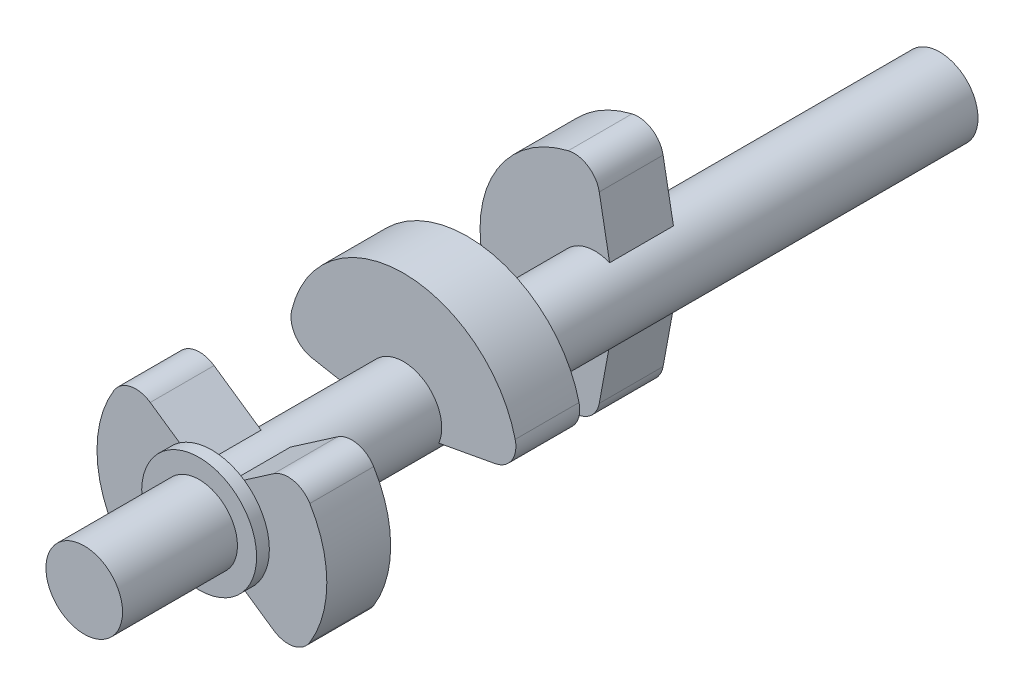
ISO-10303-21;
HEADER;
FILE_DESCRIPTION(('STEP AP214'),'2;1');
FILE_NAME('part.step','',(''),(''),'','','');
FILE_SCHEMA(('AUTOMOTIVE_DESIGN { 1 0 10303 214 1 1 1 1 }'));
ENDSEC;
DATA;
#1=APPLICATION_CONTEXT('core data for automotive mechanical design processes');
#2=APPLICATION_PROTOCOL_DEFINITION('international standard','automotive_design',2000,#1);
#3=PRODUCT_CONTEXT('',#1,'mechanical');
#4=PRODUCT('Part','Part','',(#3));
#5=PRODUCT_RELATED_PRODUCT_CATEGORY('part','',(#4));
#6=PRODUCT_DEFINITION_FORMATION('','',#4);
#7=PRODUCT_DEFINITION_CONTEXT('part definition',#1,'design');
#8=PRODUCT_DEFINITION('design','',#6,#7);
#9=PRODUCT_DEFINITION_SHAPE('','',#8);
#10=(LENGTH_UNIT() NAMED_UNIT(*) SI_UNIT(.MILLI.,.METRE.));
#11=(NAMED_UNIT(*) PLANE_ANGLE_UNIT() SI_UNIT($,.RADIAN.));
#12=(NAMED_UNIT(*) SI_UNIT($,.STERADIAN.) SOLID_ANGLE_UNIT());
#13=UNCERTAINTY_MEASURE_WITH_UNIT(LENGTH_MEASURE(1.E-05),#10,'distance_accuracy_value','');
#14=(GEOMETRIC_REPRESENTATION_CONTEXT(3) GLOBAL_UNCERTAINTY_ASSIGNED_CONTEXT((#13)) GLOBAL_UNIT_ASSIGNED_CONTEXT((#10,
#11,#12)) REPRESENTATION_CONTEXT('',''));
#15=CARTESIAN_POINT('',(0.,0.,0.));
#16=DIRECTION('',(0.,0.,1.));
#17=DIRECTION('',(1.,0.,0.));
#18=AXIS2_PLACEMENT_3D('',#15,#16,#17);
#19=CARTESIAN_POINT('',(0.,0.,33.5));
#20=DIRECTION('',(0.,0.,-1.));
#21=DIRECTION('',(-1.,0.,0.));
#22=AXIS2_PLACEMENT_3D('',#19,#20,#21);
#23=CYLINDRICAL_SURFACE('',#22,1.5);
#24=CARTESIAN_POINT('',(0.,0.,21.));
#25=DIRECTION('',(0.,0.,-1.));
#26=DIRECTION('',(-1.,0.,0.));
#27=AXIS2_PLACEMENT_3D('',#24,#25,#26);
#28=CIRCLE('',#27,1.5);
#29=CARTESIAN_POINT('',(-1.38581929876693,-0.574025148547635,21.));
#30=VERTEX_POINT('',#29);
#31=CARTESIAN_POINT('',(1.38581929876693,-0.574025148547635,21.));
#32=VERTEX_POINT('',#31);
#33=EDGE_CURVE('E300',#30,#32,#28,.T.);
#34=ORIENTED_EDGE('',*,*,#33,.F.);
#35=DIRECTION('',(0.,0.,-1.));
#36=VECTOR('',#35,1.);
#37=CARTESIAN_POINT('',(-1.38581929876693,-0.574025148547635,21.));
#38=LINE('',#37,#36);
#39=CARTESIAN_POINT('',(-1.38581929876693,-0.574025148547635,18.5));
#40=VERTEX_POINT('',#39);
#41=EDGE_CURVE('E311',#30,#40,#38,.T.);
#42=ORIENTED_EDGE('',*,*,#41,.T.);
#43=CARTESIAN_POINT('',(0.,0.,18.5));
#44=DIRECTION('',(0.,0.,-1.));
#45=DIRECTION('',(-1.,0.,0.));
#46=AXIS2_PLACEMENT_3D('',#43,#44,#45);
#47=CIRCLE('',#46,1.5);
#48=CARTESIAN_POINT('',(1.38581929876693,-0.574025148547635,18.5));
#49=VERTEX_POINT('',#48);
#50=EDGE_CURVE('E297',#40,#49,#47,.T.);
#51=ORIENTED_EDGE('',*,*,#50,.T.);
#52=DIRECTION('',(0.,0.,-1.));
#53=VECTOR('',#52,1.);
#54=CARTESIAN_POINT('',(1.38581929876693,-0.574025148547635,21.));
#55=LINE('',#54,#53);
#56=EDGE_CURVE('E320',#32,#49,#55,.T.);
#57=ORIENTED_EDGE('',*,*,#56,.F.);
#58=EDGE_LOOP('',(#34,#42,#51,#57));
#59=FACE_BOUND('',#58,.T.);
#60=CARTESIAN_POINT('',(0.,0.,0.));
#61=DIRECTION('',(0.,0.,1.));
#62=DIRECTION('',(1.,0.,0.));
#63=AXIS2_PLACEMENT_3D('',#60,#61,#62);
#64=CIRCLE('',#63,1.5);
#65=CARTESIAN_POINT('',(1.5,0.,0.));
#66=VERTEX_POINT('',#65);
#67=EDGE_CURVE('E349',#66,#66,#64,.T.);
#68=ORIENTED_EDGE('',*,*,#67,.T.);
#69=EDGE_LOOP('',(#68));
#70=FACE_BOUND('',#69,.T.);
#71=CARTESIAN_POINT('',(0.,0.,13.5));
#72=DIRECTION('',(0.,0.,-1.));
#73=DIRECTION('',(-1.,0.,0.));
#74=AXIS2_PLACEMENT_3D('',#71,#72,#73);
#75=CIRCLE('',#74,1.5);
#76=CARTESIAN_POINT('',(0.574025148547635,-1.38581929876693,13.5));
#77=VERTEX_POINT('',#76);
#78=CARTESIAN_POINT('',(0.574025148547636,1.38581929876693,13.5));
#79=VERTEX_POINT('',#78);
#80=EDGE_CURVE('E326',#77,#79,#75,.T.);
#81=ORIENTED_EDGE('',*,*,#80,.F.);
#82=DIRECTION('',(0.,0.,-1.));
#83=VECTOR('',#82,1.);
#84=CARTESIAN_POINT('',(0.574025148547635,-1.38581929876693,13.5));
#85=LINE('',#84,#83);
#86=CARTESIAN_POINT('',(0.574025148547635,-1.38581929876693,11.));
#87=VERTEX_POINT('',#86);
#88=EDGE_CURVE('E337',#77,#87,#85,.T.);
#89=ORIENTED_EDGE('',*,*,#88,.T.);
#90=CARTESIAN_POINT('',(0.,0.,11.));
#91=DIRECTION('',(0.,0.,-1.));
#92=DIRECTION('',(-1.,0.,0.));
#93=AXIS2_PLACEMENT_3D('',#90,#91,#92);
#94=CIRCLE('',#93,1.5);
#95=CARTESIAN_POINT('',(0.574025148547636,1.38581929876693,11.));
#96=VERTEX_POINT('',#95);
#97=EDGE_CURVE('E323',#87,#96,#94,.T.);
#98=ORIENTED_EDGE('',*,*,#97,.T.);
#99=DIRECTION('',(0.,0.,-1.));
#100=VECTOR('',#99,1.);
#101=CARTESIAN_POINT('',(0.574025148547636,1.38581929876693,13.5));
#102=LINE('',#101,#100);
#103=EDGE_CURVE('E346',#79,#96,#102,.T.);
#104=ORIENTED_EDGE('',*,*,#103,.F.);
#105=EDGE_LOOP('',(#81,#89,#98,#104));
#106=FACE_BOUND('',#105,.T.);
#107=CARTESIAN_POINT('',(0.,0.,28.5));
#108=DIRECTION('',(0.,0.,1.));
#109=DIRECTION('',(1.,0.,0.));
#110=AXIS2_PLACEMENT_3D('',#107,#108,#109);
#111=CIRCLE('',#110,1.5);
#112=CARTESIAN_POINT('',(0.574025148547635,1.38581929876693,28.5));
#113=VERTEX_POINT('',#112);
#114=CARTESIAN_POINT('',(-0.574025148547635,1.38581929876693,28.5));
#115=VERTEX_POINT('',#114);
#116=EDGE_CURVE('E255',#113,#115,#111,.T.);
#117=ORIENTED_EDGE('',*,*,#116,.F.);
#118=DIRECTION('',(0.,0.,-1.));
#119=VECTOR('',#118,1.);
#120=CARTESIAN_POINT('',(0.574025148547635,1.38581929876693,28.5));
#121=LINE('',#120,#119);
#122=CARTESIAN_POINT('',(0.574025148547635,1.38581929876693,26.));
#123=VERTEX_POINT('',#122);
#124=EDGE_CURVE('E285',#113,#123,#121,.T.);
#125=ORIENTED_EDGE('',*,*,#124,.T.);
#126=CARTESIAN_POINT('',(0.,0.,26.));
#127=DIRECTION('',(0.,0.,-1.));
#128=DIRECTION('',(-1.,0.,0.));
#129=AXIS2_PLACEMENT_3D('',#126,#127,#128);
#130=CIRCLE('',#129,1.5);
#131=CARTESIAN_POINT('',(0.574025148547635,-1.38581929876693,26.));
#132=VERTEX_POINT('',#131);
#133=EDGE_CURVE('E275',#123,#132,#130,.T.);
#134=ORIENTED_EDGE('',*,*,#133,.T.);
#135=DIRECTION('',(0.,0.,-1.));
#136=VECTOR('',#135,1.);
#137=CARTESIAN_POINT('',(0.574025148547635,-1.38581929876693,28.5));
#138=LINE('',#137,#136);
#139=CARTESIAN_POINT('',(0.574025148547635,-1.38581929876693,28.5));
#140=VERTEX_POINT('',#139);
#141=EDGE_CURVE('E294',#140,#132,#138,.T.);
#142=ORIENTED_EDGE('',*,*,#141,.F.);
#143=CARTESIAN_POINT('',(-0.574025148547635,-1.38581929876693,28.5));
#144=VERTEX_POINT('',#143);
#145=EDGE_CURVE('E251',#144,#140,#111,.T.);
#146=ORIENTED_EDGE('',*,*,#145,.F.);
#147=DIRECTION('',(0.,0.,-1.));
#148=VECTOR('',#147,1.);
#149=CARTESIAN_POINT('',(-0.574025148547635,-1.38581929876693,28.5));
#150=LINE('',#149,#148);
#151=CARTESIAN_POINT('',(-0.574025148547635,-1.38581929876693,26.));
#152=VERTEX_POINT('',#151);
#153=EDGE_CURVE('E232',#144,#152,#150,.T.);
#154=ORIENTED_EDGE('',*,*,#153,.T.);
#155=CARTESIAN_POINT('',(0.,0.,26.));
#156=DIRECTION('',(0.,0.,-1.));
#157=DIRECTION('',(-1.,0.,0.));
#158=AXIS2_PLACEMENT_3D('',#155,#156,#157);
#159=CIRCLE('',#158,1.5);
#160=CARTESIAN_POINT('',(-0.574025148547635,1.38581929876693,26.));
#161=VERTEX_POINT('',#160);
#162=EDGE_CURVE('E263',#152,#161,#159,.T.);
#163=ORIENTED_EDGE('',*,*,#162,.T.);
#164=DIRECTION('',(0.,0.,-1.));
#165=VECTOR('',#164,1.);
#166=CARTESIAN_POINT('',(-0.574025148547635,1.38581929876693,28.5));
#167=LINE('',#166,#165);
#168=EDGE_CURVE('E272',#115,#161,#167,.T.);
#169=ORIENTED_EDGE('',*,*,#168,.F.);
#170=EDGE_LOOP('',(#117,#125,#134,#142,#146,#154,#163,#169));
#171=FACE_BOUND('',#170,.T.);
#172=ADVANCED_FACE('F37',(#59,#70,#106,#171),#23,.T.);
#173=CARTESIAN_POINT('',(0.,0.,0.));
#174=DIRECTION('',(0.,0.,1.));
#175=DIRECTION('',(1.,0.,0.));
#176=AXIS2_PLACEMENT_3D('',#173,#174,#175);
#177=PLANE('',#176);
#178=ORIENTED_EDGE('',*,*,#67,.F.);
#179=EDGE_LOOP('',(#178));
#180=FACE_BOUND('',#179,.T.);
#181=ADVANCED_FACE('F457',(#180),#177,.F.);
#182=CARTESIAN_POINT('',(0.802211902275424,0.147868685393882,13.5));
#183=DIRECTION('',(0.983432911862671,0.181272468580607,0.));
#184=DIRECTION('',(-0.181272468580607,0.983432911862672,0.));
#185=AXIS2_PLACEMENT_3D('',#182,#183,#184);
#186=PLANE('',#185);
#187=DIRECTION('',(0.181272468580607,-0.983432911862671,0.));
#188=VECTOR('',#187,1.);
#189=CARTESIAN_POINT('',(0.802211902275424,0.147868685393882,11.));
#190=LINE('',#189,#188);
#191=CARTESIAN_POINT('',(0.168638221778177,3.5851099519235,11.));
#192=VERTEX_POINT('',#191);
#193=EDGE_CURVE('E330',#192,#96,#190,.T.);
#194=ORIENTED_EDGE('',*,*,#193,.F.);
#195=DIRECTION('',(0.,0.,-1.));
#196=VECTOR('',#195,1.);
#197=CARTESIAN_POINT('',(0.168638221778177,3.5851099519235,13.5));
#198=LINE('',#197,#196);
#199=CARTESIAN_POINT('',(0.168638221778177,3.5851099519235,13.5));
#200=VERTEX_POINT('',#199);
#201=EDGE_CURVE('E46',#192,#200,#198,.F.);
#202=ORIENTED_EDGE('',*,*,#201,.T.);
#203=DIRECTION('',(0.181272468580607,-0.983432911862671,0.));
#204=VECTOR('',#203,1.);
#205=CARTESIAN_POINT('',(0.802211902275424,0.147868685393882,13.5));
#206=LINE('',#205,#204);
#207=EDGE_CURVE('E335',#200,#79,#206,.T.);
#208=ORIENTED_EDGE('',*,*,#207,.T.);
#209=ORIENTED_EDGE('',*,*,#103,.T.);
#210=EDGE_LOOP('',(#194,#202,#208,#209));
#211=FACE_BOUND('',#210,.T.);
#212=ADVANCED_FACE('F429',(#211),#186,.T.);
#213=CARTESIAN_POINT('',(0.,0.,13.5));
#214=DIRECTION('',(0.,0.,-1.));
#215=DIRECTION('',(-1.,0.,0.));
#216=AXIS2_PLACEMENT_3D('',#213,#214,#215);
#217=CYLINDRICAL_SURFACE('',#216,4.5);
#218=CARTESIAN_POINT('',(0.,0.,11.));
#219=DIRECTION('',(0.,0.,-1.));
#220=DIRECTION('',(-1.,0.,0.));
#221=AXIS2_PLACEMENT_3D('',#218,#219,#220);
#222=CIRCLE('',#221,4.5);
#223=CARTESIAN_POINT('',(-1.04759317296578,-4.37636247858373,11.));
#224=VERTEX_POINT('',#223);
#225=CARTESIAN_POINT('',(-1.04759317296578,4.37636247858373,11.));
#226=VERTEX_POINT('',#225);
#227=EDGE_CURVE('E342',#224,#226,#222,.T.);
#228=ORIENTED_EDGE('',*,*,#227,.F.);
#229=DIRECTION('',(0.,0.,-1.));
#230=VECTOR('',#229,1.);
#231=CARTESIAN_POINT('',(-1.04759317296578,-4.37636247858373,13.5));
#232=LINE('',#231,#230);
#233=CARTESIAN_POINT('',(-1.04759317296578,-4.37636247858373,13.5));
#234=VERTEX_POINT('',#233);
#235=EDGE_CURVE('E419',#224,#234,#232,.F.);
#236=ORIENTED_EDGE('',*,*,#235,.T.);
#237=CARTESIAN_POINT('',(0.,0.,13.5));
#238=DIRECTION('',(0.,0.,-1.));
#239=DIRECTION('',(-1.,0.,0.));
#240=AXIS2_PLACEMENT_3D('',#237,#238,#239);
#241=CIRCLE('',#240,4.5);
#242=CARTESIAN_POINT('',(-1.04759317296578,4.37636247858373,13.5));
#243=VERTEX_POINT('',#242);
#244=EDGE_CURVE('E332',#234,#243,#241,.T.);
#245=ORIENTED_EDGE('',*,*,#244,.T.);
#246=DIRECTION('',(0.,0.,-1.));
#247=VECTOR('',#246,1.);
#248=CARTESIAN_POINT('',(-1.04759317296578,4.37636247858373,13.5));
#249=LINE('',#248,#247);
#250=EDGE_CURVE('E416',#243,#226,#249,.T.);
#251=ORIENTED_EDGE('',*,*,#250,.T.);
#252=EDGE_LOOP('',(#228,#236,#245,#251));
#253=FACE_BOUND('',#252,.T.);
#254=ADVANCED_FACE('F440',(#253),#217,.T.);
#255=CARTESIAN_POINT('',(0.802211902275422,-0.147868685393881,13.5));
#256=DIRECTION('',(-0.983432911862672,0.181272468580607,0.));
#257=DIRECTION('',(-0.181272468580607,-0.983432911862672,0.));
#258=AXIS2_PLACEMENT_3D('',#255,#256,#257);
#259=PLANE('',#258);
#260=DIRECTION('',(0.181272468580607,0.983432911862672,0.));
#261=VECTOR('',#260,1.);
#262=CARTESIAN_POINT('',(0.802211902275422,-0.147868685393881,13.5));
#263=LINE('',#262,#261);
#264=CARTESIAN_POINT('',(0.168638221778178,-3.58510995192351,13.5));
#265=VERTEX_POINT('',#264);
#266=EDGE_CURVE('E329',#265,#77,#263,.T.);
#267=ORIENTED_EDGE('',*,*,#266,.F.);
#268=DIRECTION('',(0.,0.,1.));
#269=VECTOR('',#268,1.);
#270=CARTESIAN_POINT('',(0.168638221778178,-3.58510995192351,11.));
#271=LINE('',#270,#269);
#272=CARTESIAN_POINT('',(0.168638221778178,-3.58510995192351,11.));
#273=VERTEX_POINT('',#272);
#274=EDGE_CURVE('E409',#265,#273,#271,.F.);
#275=ORIENTED_EDGE('',*,*,#274,.T.);
#276=DIRECTION('',(0.181272468580607,0.983432911862672,0.));
#277=VECTOR('',#276,1.);
#278=CARTESIAN_POINT('',(0.802211902275422,-0.147868685393881,11.));
#279=LINE('',#278,#277);
#280=EDGE_CURVE('E340',#273,#87,#279,.T.);
#281=ORIENTED_EDGE('',*,*,#280,.T.);
#282=ORIENTED_EDGE('',*,*,#88,.F.);
#283=EDGE_LOOP('',(#267,#275,#281,#282));
#284=FACE_BOUND('',#283,.T.);
#285=ADVANCED_FACE('F452',(#284),#259,.F.);
#286=CARTESIAN_POINT('',(0.,0.,13.5));
#287=DIRECTION('',(0.,0.,-1.));
#288=DIRECTION('',(-1.,0.,0.));
#289=AXIS2_PLACEMENT_3D('',#286,#287,#288);
#290=PLANE('',#289);
#291=ORIENTED_EDGE('',*,*,#244,.F.);
#292=CARTESIAN_POINT('',(-0.814794690084494,-3.4038374833429,13.5));
#293=DIRECTION('',(0.,0.,-1.));
#294=DIRECTION('',(-1.,0.,0.));
#295=AXIS2_PLACEMENT_3D('',#292,#293,#294);
#296=CIRCLE('',#295,1.);
#297=EDGE_CURVE('E423',#234,#265,#296,.F.);
#298=ORIENTED_EDGE('',*,*,#297,.T.);
#299=ORIENTED_EDGE('',*,*,#266,.T.);
#300=ORIENTED_EDGE('',*,*,#80,.T.);
#301=ORIENTED_EDGE('',*,*,#207,.F.);
#302=CARTESIAN_POINT('',(-0.814794690084494,3.4038374833429,13.5));
#303=DIRECTION('',(0.,0.,-1.));
#304=DIRECTION('',(-1.,0.,0.));
#305=AXIS2_PLACEMENT_3D('',#302,#303,#304);
#306=CIRCLE('',#305,1.);
#307=EDGE_CURVE('E421',#200,#243,#306,.F.);
#308=ORIENTED_EDGE('',*,*,#307,.T.);
#309=EDGE_LOOP('',(#291,#298,#299,#300,#301,#308));
#310=FACE_BOUND('',#309,.T.);
#311=ADVANCED_FACE('F434',(#310),#290,.F.);
#312=CARTESIAN_POINT('',(0.,0.,11.));
#313=DIRECTION('',(0.,0.,-1.));
#314=DIRECTION('',(-1.,0.,0.));
#315=AXIS2_PLACEMENT_3D('',#312,#313,#314);
#316=PLANE('',#315);
#317=ORIENTED_EDGE('',*,*,#280,.F.);
#318=CARTESIAN_POINT('',(-0.814794690084494,-3.4038374833429,11.));
#319=DIRECTION('',(0.,0.,-1.));
#320=DIRECTION('',(-1.,0.,0.));
#321=AXIS2_PLACEMENT_3D('',#318,#319,#320);
#322=CIRCLE('',#321,1.);
#323=EDGE_CURVE('E414',#273,#224,#322,.T.);
#324=ORIENTED_EDGE('',*,*,#323,.T.);
#325=ORIENTED_EDGE('',*,*,#227,.T.);
#326=CARTESIAN_POINT('',(-0.814794690084494,3.4038374833429,11.));
#327=DIRECTION('',(0.,0.,-1.));
#328=DIRECTION('',(-1.,0.,0.));
#329=AXIS2_PLACEMENT_3D('',#326,#327,#328);
#330=CIRCLE('',#329,1.);
#331=EDGE_CURVE('E412',#226,#192,#330,.T.);
#332=ORIENTED_EDGE('',*,*,#331,.T.);
#333=ORIENTED_EDGE('',*,*,#193,.T.);
#334=ORIENTED_EDGE('',*,*,#97,.F.);
#335=EDGE_LOOP('',(#317,#324,#325,#332,#333,#334));
#336=FACE_BOUND('',#335,.T.);
#337=ADVANCED_FACE('F444',(#336),#316,.T.);
#338=CARTESIAN_POINT('',(0.147868685393882,-0.802211902275423,21.));
#339=DIRECTION('',(0.181272468580607,-0.983432911862672,0.));
#340=DIRECTION('',(0.983432911862672,0.181272468580607,0.));
#341=AXIS2_PLACEMENT_3D('',#338,#339,#340);
#342=PLANE('',#341);
#343=DIRECTION('',(-0.983432911862672,-0.181272468580607,0.));
#344=VECTOR('',#343,1.);
#345=CARTESIAN_POINT('',(0.147868685393882,-0.802211902275423,18.5));
#346=LINE('',#345,#344);
#347=CARTESIAN_POINT('',(3.58510995192351,-0.168638221778178,18.5));
#348=VERTEX_POINT('',#347);
#349=EDGE_CURVE('E304',#348,#49,#346,.T.);
#350=ORIENTED_EDGE('',*,*,#349,.F.);
#351=DIRECTION('',(0.,0.,-1.));
#352=VECTOR('',#351,1.);
#353=CARTESIAN_POINT('',(3.5851099519235,-0.168638221778178,21.));
#354=LINE('',#353,#352);
#355=CARTESIAN_POINT('',(3.58510995192351,-0.168638221778178,21.));
#356=VERTEX_POINT('',#355);
#357=EDGE_CURVE('E407',#348,#356,#354,.F.);
#358=ORIENTED_EDGE('',*,*,#357,.T.);
#359=DIRECTION('',(-0.983432911862672,-0.181272468580607,0.));
#360=VECTOR('',#359,1.);
#361=CARTESIAN_POINT('',(0.147868685393882,-0.802211902275423,21.));
#362=LINE('',#361,#360);
#363=EDGE_CURVE('E309',#356,#32,#362,.T.);
#364=ORIENTED_EDGE('',*,*,#363,.T.);
#365=ORIENTED_EDGE('',*,*,#56,.T.);
#366=EDGE_LOOP('',(#350,#358,#364,#365));
#367=FACE_BOUND('',#366,.T.);
#368=ADVANCED_FACE('F665',(#367),#342,.T.);
#369=CARTESIAN_POINT('',(0.,0.,21.));
#370=DIRECTION('',(0.,0.,-1.));
#371=DIRECTION('',(-1.,0.,0.));
#372=AXIS2_PLACEMENT_3D('',#369,#370,#371);
#373=CYLINDRICAL_SURFACE('',#372,4.5);
#374=CARTESIAN_POINT('',(0.,0.,18.5));
#375=DIRECTION('',(0.,0.,-1.));
#376=DIRECTION('',(-1.,0.,0.));
#377=AXIS2_PLACEMENT_3D('',#374,#375,#376);
#378=CIRCLE('',#377,4.5);
#379=CARTESIAN_POINT('',(-4.37636247858373,1.04759317296578,18.5));
#380=VERTEX_POINT('',#379);
#381=CARTESIAN_POINT('',(4.37636247858373,1.04759317296578,18.5));
#382=VERTEX_POINT('',#381);
#383=EDGE_CURVE('E316',#380,#382,#378,.T.);
#384=ORIENTED_EDGE('',*,*,#383,.F.);
#385=DIRECTION('',(0.,0.,-1.));
#386=VECTOR('',#385,1.);
#387=CARTESIAN_POINT('',(-4.37636247858373,1.04759317296578,21.));
#388=LINE('',#387,#386);
#389=CARTESIAN_POINT('',(-4.37636247858373,1.04759317296578,21.));
#390=VERTEX_POINT('',#389);
#391=EDGE_CURVE('E401',#380,#390,#388,.F.);
#392=ORIENTED_EDGE('',*,*,#391,.T.);
#393=CARTESIAN_POINT('',(0.,0.,21.));
#394=DIRECTION('',(0.,0.,-1.));
#395=DIRECTION('',(-1.,0.,0.));
#396=AXIS2_PLACEMENT_3D('',#393,#394,#395);
#397=CIRCLE('',#396,4.5);
#398=CARTESIAN_POINT('',(4.37636247858373,1.04759317296578,21.));
#399=VERTEX_POINT('',#398);
#400=EDGE_CURVE('E306',#390,#399,#397,.T.);
#401=ORIENTED_EDGE('',*,*,#400,.T.);
#402=DIRECTION('',(0.,0.,-1.));
#403=VECTOR('',#402,1.);
#404=CARTESIAN_POINT('',(4.37636247858373,1.04759317296578,21.));
#405=LINE('',#404,#403);
#406=EDGE_CURVE('E398',#399,#382,#405,.T.);
#407=ORIENTED_EDGE('',*,*,#406,.T.);
#408=EDGE_LOOP('',(#384,#392,#401,#407));
#409=FACE_BOUND('',#408,.T.);
#410=ADVANCED_FACE('F656',(#409),#373,.T.);
#411=CARTESIAN_POINT('',(-0.147868685393882,-0.802211902275423,21.));
#412=DIRECTION('',(0.181272468580607,0.983432911862671,0.));
#413=DIRECTION('',(-0.983432911862672,0.181272468580607,0.));
#414=AXIS2_PLACEMENT_3D('',#411,#412,#413);
#415=PLANE('',#414);
#416=DIRECTION('',(0.983432911862672,-0.181272468580607,0.));
#417=VECTOR('',#416,1.);
#418=CARTESIAN_POINT('',(-0.147868685393882,-0.802211902275423,21.));
#419=LINE('',#418,#417);
#420=CARTESIAN_POINT('',(-3.58510995192351,-0.168638221778176,21.));
#421=VERTEX_POINT('',#420);
#422=EDGE_CURVE('E303',#421,#30,#419,.T.);
#423=ORIENTED_EDGE('',*,*,#422,.F.);
#424=DIRECTION('',(0.,0.,1.));
#425=VECTOR('',#424,1.);
#426=CARTESIAN_POINT('',(-3.5851099519235,-0.168638221778176,18.5));
#427=LINE('',#426,#425);
#428=CARTESIAN_POINT('',(-3.58510995192351,-0.168638221778176,18.5));
#429=VERTEX_POINT('',#428);
#430=EDGE_CURVE('E391',#421,#429,#427,.F.);
#431=ORIENTED_EDGE('',*,*,#430,.T.);
#432=DIRECTION('',(0.983432911862672,-0.181272468580607,0.));
#433=VECTOR('',#432,1.);
#434=CARTESIAN_POINT('',(-0.147868685393882,-0.802211902275423,18.5));
#435=LINE('',#434,#433);
#436=EDGE_CURVE('E314',#429,#40,#435,.T.);
#437=ORIENTED_EDGE('',*,*,#436,.T.);
#438=ORIENTED_EDGE('',*,*,#41,.F.);
#439=EDGE_LOOP('',(#423,#431,#437,#438));
#440=FACE_BOUND('',#439,.T.);
#441=ADVANCED_FACE('F647',(#440),#415,.F.);
#442=CARTESIAN_POINT('',(0.,0.,21.));
#443=DIRECTION('',(0.,0.,-1.));
#444=DIRECTION('',(-1.,0.,0.));
#445=AXIS2_PLACEMENT_3D('',#442,#443,#444);
#446=PLANE('',#445);
#447=ORIENTED_EDGE('',*,*,#400,.F.);
#448=CARTESIAN_POINT('',(-3.4038374833429,0.814794690084495,21.));
#449=DIRECTION('',(0.,0.,-1.));
#450=DIRECTION('',(-1.,0.,0.));
#451=AXIS2_PLACEMENT_3D('',#448,#449,#450);
#452=CIRCLE('',#451,1.);
#453=EDGE_CURVE('E405',#390,#421,#452,.F.);
#454=ORIENTED_EDGE('',*,*,#453,.T.);
#455=ORIENTED_EDGE('',*,*,#422,.T.);
#456=ORIENTED_EDGE('',*,*,#33,.T.);
#457=ORIENTED_EDGE('',*,*,#363,.F.);
#458=CARTESIAN_POINT('',(3.4038374833429,0.814794690084494,21.));
#459=DIRECTION('',(0.,0.,-1.));
#460=DIRECTION('',(-1.,0.,0.));
#461=AXIS2_PLACEMENT_3D('',#458,#459,#460);
#462=CIRCLE('',#461,1.);
#463=EDGE_CURVE('E403',#356,#399,#462,.F.);
#464=ORIENTED_EDGE('',*,*,#463,.T.);
#465=EDGE_LOOP('',(#447,#454,#455,#456,#457,#464));
#466=FACE_BOUND('',#465,.T.);
#467=ADVANCED_FACE('F637',(#466),#446,.F.);
#468=CARTESIAN_POINT('',(0.,0.,18.5));
#469=DIRECTION('',(0.,0.,-1.));
#470=DIRECTION('',(-1.,0.,0.));
#471=AXIS2_PLACEMENT_3D('',#468,#469,#470);
#472=PLANE('',#471);
#473=ORIENTED_EDGE('',*,*,#436,.F.);
#474=CARTESIAN_POINT('',(-3.4038374833429,0.814794690084495,18.5));
#475=DIRECTION('',(0.,0.,-1.));
#476=DIRECTION('',(-1.,0.,0.));
#477=AXIS2_PLACEMENT_3D('',#474,#475,#476);
#478=CIRCLE('',#477,1.);
#479=EDGE_CURVE('E396',#429,#380,#478,.T.);
#480=ORIENTED_EDGE('',*,*,#479,.T.);
#481=ORIENTED_EDGE('',*,*,#383,.T.);
#482=CARTESIAN_POINT('',(3.4038374833429,0.814794690084494,18.5));
#483=DIRECTION('',(0.,0.,-1.));
#484=DIRECTION('',(-1.,0.,0.));
#485=AXIS2_PLACEMENT_3D('',#482,#483,#484);
#486=CIRCLE('',#485,1.);
#487=EDGE_CURVE('E394',#382,#348,#486,.T.);
#488=ORIENTED_EDGE('',*,*,#487,.T.);
#489=ORIENTED_EDGE('',*,*,#349,.T.);
#490=ORIENTED_EDGE('',*,*,#50,.F.);
#491=EDGE_LOOP('',(#473,#480,#481,#488,#489,#490));
#492=FACE_BOUND('',#491,.T.);
#493=ADVANCED_FACE('F552',(#492),#472,.T.);
#494=CARTESIAN_POINT('',(-0.462690525880357,-0.671808426214665,28.5));
#495=DIRECTION('',(-0.567213089044355,-0.8235710725959,0.));
#496=DIRECTION('',(0.8235710725959,-0.567213089044355,0.));
#497=AXIS2_PLACEMENT_3D('',#494,#495,#496);
#498=PLANE('',#497);
#499=DIRECTION('',(-0.8235710725959,0.567213089044355,0.));
#500=VECTOR('',#499,1.);
#501=CARTESIAN_POINT('',(-0.462690525880357,-0.671808426214665,26.));
#502=LINE('',#501,#500);
#503=CARTESIAN_POINT('',(2.4158103281179,-2.65430078849108,26.));
#504=VERTEX_POINT('',#503);
#505=EDGE_CURVE('E280',#504,#132,#502,.T.);
#506=ORIENTED_EDGE('',*,*,#505,.F.);
#507=DIRECTION('',(0.,0.,-1.));
#508=VECTOR('',#507,1.);
#509=CARTESIAN_POINT('',(2.4158103281179,-2.65430078849108,28.5));
#510=LINE('',#509,#508);
#511=CARTESIAN_POINT('',(2.4158103281179,-2.65430078849108,28.5));
#512=VERTEX_POINT('',#511);
#513=EDGE_CURVE('E387',#504,#512,#510,.F.);
#514=ORIENTED_EDGE('',*,*,#513,.T.);
#515=DIRECTION('',(-0.8235710725959,0.567213089044355,0.));
#516=VECTOR('',#515,1.);
#517=CARTESIAN_POINT('',(-0.462690525880357,-0.671808426214665,28.5));
#518=LINE('',#517,#516);
#519=CARTESIAN_POINT('',(1.2642755503721,-1.86121125419209,28.5));
#520=VERTEX_POINT('',#519);
#521=EDGE_CURVE('E283',#512,#520,#518,.T.);
#522=ORIENTED_EDGE('',*,*,#521,.T.);
#523=DIRECTION('',(-0.8235710725959,0.567213089044355,0.));
#524=VECTOR('',#523,1.);
#525=CARTESIAN_POINT('',(-0.462690525880357,-0.671808426214665,28.5));
#526=LINE('',#525,#524);
#527=EDGE_CURVE('E240',#520,#140,#526,.T.);
#528=ORIENTED_EDGE('',*,*,#527,.T.);
#529=ORIENTED_EDGE('',*,*,#141,.T.);
#530=EDGE_LOOP('',(#506,#514,#522,#528,#529));
#531=FACE_BOUND('',#530,.T.);
#532=ADVANCED_FACE('F546',(#531),#498,.T.);
#533=CARTESIAN_POINT('',(0.,0.,28.5));
#534=DIRECTION('',(0.,0.,-1.));
#535=DIRECTION('',(-1.,0.,0.));
#536=AXIS2_PLACEMENT_3D('',#533,#534,#535);
#537=CYLINDRICAL_SURFACE('',#536,4.5);
#538=CARTESIAN_POINT('',(0.,0.,26.));
#539=DIRECTION('',(0.,0.,-1.));
#540=DIRECTION('',(-1.,0.,0.));
#541=AXIS2_PLACEMENT_3D('',#538,#539,#540);
#542=CIRCLE('',#541,4.5);
#543=CARTESIAN_POINT('',(3.83531582206575,2.35379534900808,26.));
#544=VERTEX_POINT('',#543);
#545=CARTESIAN_POINT('',(3.83531582206575,-2.35379534900808,26.));
#546=VERTEX_POINT('',#545);
#547=EDGE_CURVE('E290',#544,#546,#542,.T.);
#548=ORIENTED_EDGE('',*,*,#547,.F.);
#549=DIRECTION('',(0.,0.,-1.));
#550=VECTOR('',#549,1.);
#551=CARTESIAN_POINT('',(3.83531582206575,2.35379534900808,28.5));
#552=LINE('',#551,#550);
#553=CARTESIAN_POINT('',(3.83531582206575,2.35379534900808,28.5));
#554=VERTEX_POINT('',#553);
#555=EDGE_CURVE('E381',#544,#554,#552,.F.);
#556=ORIENTED_EDGE('',*,*,#555,.T.);
#557=CARTESIAN_POINT('',(0.,0.,28.5));
#558=DIRECTION('',(0.,0.,-1.));
#559=DIRECTION('',(-1.,0.,0.));
#560=AXIS2_PLACEMENT_3D('',#557,#558,#559);
#561=CIRCLE('',#560,4.5);
#562=CARTESIAN_POINT('',(3.83531582206575,-2.35379534900808,28.5));
#563=VERTEX_POINT('',#562);
#564=EDGE_CURVE('E279',#554,#563,#561,.T.);
#565=ORIENTED_EDGE('',*,*,#564,.T.);
#566=DIRECTION('',(0.,0.,-1.));
#567=VECTOR('',#566,1.);
#568=CARTESIAN_POINT('',(3.83531582206575,-2.35379534900809,28.5));
#569=LINE('',#568,#567);
#570=EDGE_CURVE('E378',#563,#546,#569,.T.);
#571=ORIENTED_EDGE('',*,*,#570,.T.);
#572=EDGE_LOOP('',(#548,#556,#565,#571));
#573=FACE_BOUND('',#572,.T.);
#574=ADVANCED_FACE('F551',(#573),#537,.T.);
#575=CARTESIAN_POINT('',(-0.462690525880357,0.671808426214665,28.5));
#576=DIRECTION('',(0.567213089044355,-0.8235710725959,0.));
#577=DIRECTION('',(0.8235710725959,0.567213089044355,0.));
#578=AXIS2_PLACEMENT_3D('',#575,#576,#577);
#579=PLANE('',#578);
#580=DIRECTION('',(-0.8235710725959,-0.567213089044355,0.));
#581=VECTOR('',#580,1.);
#582=CARTESIAN_POINT('',(-0.462690525880357,0.671808426214665,28.5));
#583=LINE('',#582,#581);
#584=CARTESIAN_POINT('',(2.4158103281179,2.65430078849108,28.5));
#585=VERTEX_POINT('',#584);
#586=CARTESIAN_POINT('',(1.26427555037211,1.8612112541921,28.5));
#587=VERTEX_POINT('',#586);
#588=EDGE_CURVE('E277',#585,#587,#583,.T.);
#589=ORIENTED_EDGE('',*,*,#588,.F.);
#590=DIRECTION('',(0.,0.,1.));
#591=VECTOR('',#590,1.);
#592=CARTESIAN_POINT('',(2.4158103281179,2.65430078849108,26.));
#593=LINE('',#592,#591);
#594=CARTESIAN_POINT('',(2.4158103281179,2.65430078849108,26.));
#595=VERTEX_POINT('',#594);
#596=EDGE_CURVE('E371',#585,#595,#593,.F.);
#597=ORIENTED_EDGE('',*,*,#596,.T.);
#598=DIRECTION('',(-0.8235710725959,-0.567213089044355,0.));
#599=VECTOR('',#598,1.);
#600=CARTESIAN_POINT('',(-0.462690525880357,0.671808426214665,26.));
#601=LINE('',#600,#599);
#602=EDGE_CURVE('E288',#595,#123,#601,.T.);
#603=ORIENTED_EDGE('',*,*,#602,.T.);
#604=ORIENTED_EDGE('',*,*,#124,.F.);
#605=DIRECTION('',(-0.8235710725959,-0.567213089044355,0.));
#606=VECTOR('',#605,1.);
#607=CARTESIAN_POINT('',(-0.462690525880357,0.671808426214665,28.5));
#608=LINE('',#607,#606);
#609=EDGE_CURVE('E61',#587,#113,#608,.T.);
#610=ORIENTED_EDGE('',*,*,#609,.F.);
#611=EDGE_LOOP('',(#589,#597,#603,#604,#610));
#612=FACE_BOUND('',#611,.T.);
#613=ADVANCED_FACE('F463',(#612),#579,.F.);
#614=CARTESIAN_POINT('',(0.,0.,28.5));
#615=DIRECTION('',(0.,0.,-1.));
#616=DIRECTION('',(-1.,0.,0.));
#617=AXIS2_PLACEMENT_3D('',#614,#615,#616);
#618=PLANE('',#617);
#619=CARTESIAN_POINT('',(0.,0.,28.5));
#620=DIRECTION('',(0.,0.,1.));
#621=DIRECTION('',(1.,0.,0.));
#622=AXIS2_PLACEMENT_3D('',#619,#620,#621);
#623=CIRCLE('',#622,2.25);
#624=EDGE_CURVE('E53',#520,#587,#623,.T.);
#625=ORIENTED_EDGE('',*,*,#624,.F.);
#626=ORIENTED_EDGE('',*,*,#521,.F.);
#627=CARTESIAN_POINT('',(2.98302341716225,-1.83072971589518,28.5));
#628=DIRECTION('',(0.,0.,-1.));
#629=DIRECTION('',(-1.,0.,0.));
#630=AXIS2_PLACEMENT_3D('',#627,#628,#629);
#631=CIRCLE('',#630,1.);
#632=EDGE_CURVE('E383',#512,#563,#631,.F.);
#633=ORIENTED_EDGE('',*,*,#632,.T.);
#634=ORIENTED_EDGE('',*,*,#564,.F.);
#635=CARTESIAN_POINT('',(2.98302341716225,1.83072971589518,28.5));
#636=DIRECTION('',(0.,0.,-1.));
#637=DIRECTION('',(-1.,0.,0.));
#638=AXIS2_PLACEMENT_3D('',#635,#636,#637);
#639=CIRCLE('',#638,1.);
#640=EDGE_CURVE('E385',#554,#585,#639,.F.);
#641=ORIENTED_EDGE('',*,*,#640,.T.);
#642=ORIENTED_EDGE('',*,*,#588,.T.);
#643=EDGE_LOOP('',(#625,#626,#633,#634,#641,#642));
#644=FACE_BOUND('',#643,.T.);
#645=ADVANCED_FACE('F566',(#644),#618,.F.);
#646=CARTESIAN_POINT('',(0.,0.,26.));
#647=DIRECTION('',(0.,0.,-1.));
#648=DIRECTION('',(-1.,0.,0.));
#649=AXIS2_PLACEMENT_3D('',#646,#647,#648);
#650=PLANE('',#649);
#651=ORIENTED_EDGE('',*,*,#602,.F.);
#652=CARTESIAN_POINT('',(2.98302341716225,1.83072971589518,26.));
#653=DIRECTION('',(0.,0.,-1.));
#654=DIRECTION('',(-1.,0.,0.));
#655=AXIS2_PLACEMENT_3D('',#652,#653,#654);
#656=CIRCLE('',#655,1.);
#657=EDGE_CURVE('E376',#595,#544,#656,.T.);
#658=ORIENTED_EDGE('',*,*,#657,.T.);
#659=ORIENTED_EDGE('',*,*,#547,.T.);
#660=CARTESIAN_POINT('',(2.98302341716225,-1.83072971589518,26.));
#661=DIRECTION('',(0.,0.,-1.));
#662=DIRECTION('',(-1.,0.,0.));
#663=AXIS2_PLACEMENT_3D('',#660,#661,#662);
#664=CIRCLE('',#663,1.);
#665=EDGE_CURVE('E374',#546,#504,#664,.T.);
#666=ORIENTED_EDGE('',*,*,#665,.T.);
#667=ORIENTED_EDGE('',*,*,#505,.T.);
#668=ORIENTED_EDGE('',*,*,#133,.F.);
#669=EDGE_LOOP('',(#651,#658,#659,#666,#667,#668));
#670=FACE_BOUND('',#669,.T.);
#671=ADVANCED_FACE('F575',(#670),#650,.T.);
#672=CARTESIAN_POINT('',(0.462690525880358,0.671808426214665,28.5));
#673=DIRECTION('',(0.567213089044356,0.823571072595899,0.));
#674=DIRECTION('',(-0.823571072595899,0.567213089044356,0.));
#675=AXIS2_PLACEMENT_3D('',#672,#673,#674);
#676=PLANE('',#675);
#677=DIRECTION('',(0.823571072595899,-0.567213089044356,0.));
#678=VECTOR('',#677,1.);
#679=CARTESIAN_POINT('',(0.462690525880358,0.671808426214665,26.));
#680=LINE('',#679,#678);
#681=CARTESIAN_POINT('',(-2.4158103281179,2.65430078849108,26.));
#682=VERTEX_POINT('',#681);
#683=EDGE_CURVE('E235',#682,#161,#680,.T.);
#684=ORIENTED_EDGE('',*,*,#683,.F.);
#685=DIRECTION('',(0.,0.,-1.));
#686=VECTOR('',#685,1.);
#687=CARTESIAN_POINT('',(-2.4158103281179,2.65430078849108,28.5));
#688=LINE('',#687,#686);
#689=CARTESIAN_POINT('',(-2.4158103281179,2.65430078849108,28.5));
#690=VERTEX_POINT('',#689);
#691=EDGE_CURVE('E366',#682,#690,#688,.F.);
#692=ORIENTED_EDGE('',*,*,#691,.T.);
#693=DIRECTION('',(0.823571072595899,-0.567213089044356,0.));
#694=VECTOR('',#693,1.);
#695=CARTESIAN_POINT('',(0.462690525880358,0.671808426214665,28.5));
#696=LINE('',#695,#694);
#697=CARTESIAN_POINT('',(-1.2642755503721,1.8612112541921,28.5));
#698=VERTEX_POINT('',#697);
#699=EDGE_CURVE('E261',#690,#698,#696,.T.);
#700=ORIENTED_EDGE('',*,*,#699,.T.);
#701=EDGE_CURVE('E260',#698,#115,#696,.T.);
#702=ORIENTED_EDGE('',*,*,#701,.T.);
#703=ORIENTED_EDGE('',*,*,#168,.T.);
#704=EDGE_LOOP('',(#684,#692,#700,#702,#703));
#705=FACE_BOUND('',#704,.T.);
#706=ADVANCED_FACE('F582',(#705),#676,.T.);
#707=CARTESIAN_POINT('',(0.,0.,28.5));
#708=DIRECTION('',(0.,0.,-1.));
#709=DIRECTION('',(-1.,0.,0.));
#710=AXIS2_PLACEMENT_3D('',#707,#708,#709);
#711=CYLINDRICAL_SURFACE('',#710,4.5);
#712=CARTESIAN_POINT('',(0.,0.,28.5));
#713=DIRECTION('',(0.,0.,-1.));
#714=DIRECTION('',(-1.,0.,0.));
#715=AXIS2_PLACEMENT_3D('',#712,#713,#714);
#716=CIRCLE('',#715,4.5);
#717=CARTESIAN_POINT('',(-3.83531582206575,-2.35379534900808,28.5));
#718=VERTEX_POINT('',#717);
#719=CARTESIAN_POINT('',(-3.83531582206575,2.35379534900809,28.5));
#720=VERTEX_POINT('',#719);
#721=EDGE_CURVE('E224',#718,#720,#716,.T.);
#722=ORIENTED_EDGE('',*,*,#721,.T.);
#723=DIRECTION('',(0.,0.,-1.));
#724=VECTOR('',#723,1.);
#725=CARTESIAN_POINT('',(-3.83531582206575,2.35379534900809,28.5));
#726=LINE('',#725,#724);
#727=CARTESIAN_POINT('',(-3.83531582206575,2.35379534900809,26.));
#728=VERTEX_POINT('',#727);
#729=EDGE_CURVE('E359',#720,#728,#726,.T.);
#730=ORIENTED_EDGE('',*,*,#729,.T.);
#731=CARTESIAN_POINT('',(0.,0.,26.));
#732=DIRECTION('',(0.,0.,-1.));
#733=DIRECTION('',(-1.,0.,0.));
#734=AXIS2_PLACEMENT_3D('',#731,#732,#733);
#735=CIRCLE('',#734,4.5);
#736=CARTESIAN_POINT('',(-3.83531582206575,-2.35379534900808,26.));
#737=VERTEX_POINT('',#736);
#738=EDGE_CURVE('E268',#737,#728,#735,.T.);
#739=ORIENTED_EDGE('',*,*,#738,.F.);
#740=DIRECTION('',(0.,0.,-1.));
#741=VECTOR('',#740,1.);
#742=CARTESIAN_POINT('',(-3.83531582206575,-2.35379534900808,28.5));
#743=LINE('',#742,#741);
#744=EDGE_CURVE('E355',#737,#718,#743,.F.);
#745=ORIENTED_EDGE('',*,*,#744,.T.);
#746=EDGE_LOOP('',(#722,#730,#739,#745));
#747=FACE_BOUND('',#746,.T.);
#748=ADVANCED_FACE('F587',(#747),#711,.T.);
#749=CARTESIAN_POINT('',(0.462690525880357,-0.671808426214666,28.5));
#750=DIRECTION('',(-0.567213089044355,0.8235710725959,0.));
#751=DIRECTION('',(-0.8235710725959,-0.567213089044355,0.));
#752=AXIS2_PLACEMENT_3D('',#749,#750,#751);
#753=PLANE('',#752);
#754=DIRECTION('',(0.8235710725959,0.567213089044355,0.));
#755=VECTOR('',#754,1.);
#756=CARTESIAN_POINT('',(0.462690525880357,-0.671808426214666,28.5));
#757=LINE('',#756,#755);
#758=CARTESIAN_POINT('',(-2.4158103281179,-2.65430078849108,28.5));
#759=VERTEX_POINT('',#758);
#760=CARTESIAN_POINT('',(-1.26427555037211,-1.86121125419209,28.5));
#761=VERTEX_POINT('',#760);
#762=EDGE_CURVE('E213',#759,#761,#757,.T.);
#763=ORIENTED_EDGE('',*,*,#762,.F.);
#764=DIRECTION('',(0.,0.,1.));
#765=VECTOR('',#764,1.);
#766=CARTESIAN_POINT('',(-2.4158103281179,-2.65430078849108,26.));
#767=LINE('',#766,#765);
#768=CARTESIAN_POINT('',(-2.4158103281179,-2.65430078849108,26.));
#769=VERTEX_POINT('',#768);
#770=EDGE_CURVE('E389',#759,#769,#767,.F.);
#771=ORIENTED_EDGE('',*,*,#770,.T.);
#772=DIRECTION('',(0.8235710725959,0.567213089044355,0.));
#773=VECTOR('',#772,1.);
#774=CARTESIAN_POINT('',(0.462690525880357,-0.671808426214666,26.));
#775=LINE('',#774,#773);
#776=EDGE_CURVE('E266',#769,#152,#775,.T.);
#777=ORIENTED_EDGE('',*,*,#776,.T.);
#778=ORIENTED_EDGE('',*,*,#153,.F.);
#779=EDGE_CURVE('E225',#761,#144,#757,.T.);
#780=ORIENTED_EDGE('',*,*,#779,.F.);
#781=EDGE_LOOP('',(#763,#771,#777,#778,#780));
#782=FACE_BOUND('',#781,.T.);
#783=ADVANCED_FACE('F230',(#782),#753,.F.);
#784=CARTESIAN_POINT('',(0.,0.,28.5));
#785=DIRECTION('',(0.,0.,-1.));
#786=DIRECTION('',(-1.,0.,0.));
#787=AXIS2_PLACEMENT_3D('',#784,#785,#786);
#788=PLANE('',#787);
#789=CARTESIAN_POINT('',(0.,0.,28.5));
#790=DIRECTION('',(0.,0.,-1.));
#791=DIRECTION('',(-1.,0.,0.));
#792=AXIS2_PLACEMENT_3D('',#789,#790,#791);
#793=CIRCLE('',#792,2.25);
#794=EDGE_CURVE('E11',#698,#761,#793,.F.);
#795=ORIENTED_EDGE('',*,*,#794,.F.);
#796=ORIENTED_EDGE('',*,*,#699,.F.);
#797=CARTESIAN_POINT('',(-2.98302341716225,1.83072971589518,28.5));
#798=DIRECTION('',(0.,0.,-1.));
#799=DIRECTION('',(-1.,0.,0.));
#800=AXIS2_PLACEMENT_3D('',#797,#798,#799);
#801=CIRCLE('',#800,1.);
#802=EDGE_CURVE('E369',#690,#720,#801,.F.);
#803=ORIENTED_EDGE('',*,*,#802,.T.);
#804=ORIENTED_EDGE('',*,*,#721,.F.);
#805=CARTESIAN_POINT('',(-2.98302341716225,-1.83072971589518,28.5));
#806=DIRECTION('',(0.,0.,-1.));
#807=DIRECTION('',(-1.,0.,0.));
#808=AXIS2_PLACEMENT_3D('',#805,#806,#807);
#809=CIRCLE('',#808,1.);
#810=EDGE_CURVE('E220',#718,#759,#809,.F.);
#811=ORIENTED_EDGE('',*,*,#810,.T.);
#812=ORIENTED_EDGE('',*,*,#762,.T.);
#813=EDGE_LOOP('',(#795,#796,#803,#804,#811,#812));
#814=FACE_BOUND('',#813,.T.);
#815=ADVANCED_FACE('F215',(#814),#788,.F.);
#816=CARTESIAN_POINT('',(0.,0.,26.));
#817=DIRECTION('',(0.,0.,-1.));
#818=DIRECTION('',(-1.,0.,0.));
#819=AXIS2_PLACEMENT_3D('',#816,#817,#818);
#820=PLANE('',#819);
#821=ORIENTED_EDGE('',*,*,#738,.T.);
#822=CARTESIAN_POINT('',(-2.98302341716225,1.83072971589518,26.));
#823=DIRECTION('',(0.,0.,-1.));
#824=DIRECTION('',(-1.,0.,0.));
#825=AXIS2_PLACEMENT_3D('',#822,#823,#824);
#826=CIRCLE('',#825,1.);
#827=EDGE_CURVE('E364',#728,#682,#826,.T.);
#828=ORIENTED_EDGE('',*,*,#827,.T.);
#829=ORIENTED_EDGE('',*,*,#683,.T.);
#830=ORIENTED_EDGE('',*,*,#162,.F.);
#831=ORIENTED_EDGE('',*,*,#776,.F.);
#832=CARTESIAN_POINT('',(-2.98302341716225,-1.83072971589518,26.));
#833=DIRECTION('',(0.,0.,-1.));
#834=DIRECTION('',(-1.,0.,0.));
#835=AXIS2_PLACEMENT_3D('',#832,#833,#834);
#836=CIRCLE('',#835,1.);
#837=EDGE_CURVE('E362',#769,#737,#836,.T.);
#838=ORIENTED_EDGE('',*,*,#837,.T.);
#839=EDGE_LOOP('',(#821,#828,#829,#830,#831,#838));
#840=FACE_BOUND('',#839,.T.);
#841=ADVANCED_FACE('F504',(#840),#820,.T.);
#842=CARTESIAN_POINT('',(-2.98302341716225,1.83072971589518,28.5));
#843=DIRECTION('',(0.,0.,-1.));
#844=DIRECTION('',(-1.,0.,0.));
#845=AXIS2_PLACEMENT_3D('',#842,#843,#844);
#846=CYLINDRICAL_SURFACE('',#845,1.);
#847=ORIENTED_EDGE('',*,*,#802,.F.);
#848=ORIENTED_EDGE('',*,*,#691,.F.);
#849=ORIENTED_EDGE('',*,*,#827,.F.);
#850=ORIENTED_EDGE('',*,*,#729,.F.);
#851=EDGE_LOOP('',(#847,#848,#849,#850));
#852=FACE_BOUND('',#851,.T.);
#853=ADVANCED_FACE('F500',(#852),#846,.T.);
#854=CARTESIAN_POINT('',(2.98302341716225,1.83072971589518,28.5));
#855=DIRECTION('',(0.,0.,-1.));
#856=DIRECTION('',(-1.,0.,0.));
#857=AXIS2_PLACEMENT_3D('',#854,#855,#856);
#858=CYLINDRICAL_SURFACE('',#857,1.);
#859=ORIENTED_EDGE('',*,*,#640,.F.);
#860=ORIENTED_EDGE('',*,*,#555,.F.);
#861=ORIENTED_EDGE('',*,*,#657,.F.);
#862=ORIENTED_EDGE('',*,*,#596,.F.);
#863=EDGE_LOOP('',(#859,#860,#861,#862));
#864=FACE_BOUND('',#863,.T.);
#865=ADVANCED_FACE('F503',(#864),#858,.T.);
#866=CARTESIAN_POINT('',(2.98302341716225,-1.83072971589518,28.5));
#867=DIRECTION('',(0.,0.,-1.));
#868=DIRECTION('',(-1.,0.,0.));
#869=AXIS2_PLACEMENT_3D('',#866,#867,#868);
#870=CYLINDRICAL_SURFACE('',#869,1.);
#871=ORIENTED_EDGE('',*,*,#632,.F.);
#872=ORIENTED_EDGE('',*,*,#513,.F.);
#873=ORIENTED_EDGE('',*,*,#665,.F.);
#874=ORIENTED_EDGE('',*,*,#570,.F.);
#875=EDGE_LOOP('',(#871,#872,#873,#874));
#876=FACE_BOUND('',#875,.T.);
#877=ADVANCED_FACE('F508',(#876),#870,.T.);
#878=CARTESIAN_POINT('',(-2.98302341716225,-1.83072971589518,28.5));
#879=DIRECTION('',(0.,0.,-1.));
#880=DIRECTION('',(-1.,0.,0.));
#881=AXIS2_PLACEMENT_3D('',#878,#879,#880);
#882=CYLINDRICAL_SURFACE('',#881,1.);
#883=ORIENTED_EDGE('',*,*,#810,.F.);
#884=ORIENTED_EDGE('',*,*,#744,.F.);
#885=ORIENTED_EDGE('',*,*,#837,.F.);
#886=ORIENTED_EDGE('',*,*,#770,.F.);
#887=EDGE_LOOP('',(#883,#884,#885,#886));
#888=FACE_BOUND('',#887,.T.);
#889=ADVANCED_FACE('F512',(#888),#882,.T.);
#890=CARTESIAN_POINT('',(-3.4038374833429,0.814794690084495,21.));
#891=DIRECTION('',(0.,0.,-1.));
#892=DIRECTION('',(-1.,0.,0.));
#893=AXIS2_PLACEMENT_3D('',#890,#891,#892);
#894=CYLINDRICAL_SURFACE('',#893,1.);
#895=ORIENTED_EDGE('',*,*,#453,.F.);
#896=ORIENTED_EDGE('',*,*,#391,.F.);
#897=ORIENTED_EDGE('',*,*,#479,.F.);
#898=ORIENTED_EDGE('',*,*,#430,.F.);
#899=EDGE_LOOP('',(#895,#896,#897,#898));
#900=FACE_BOUND('',#899,.T.);
#901=ADVANCED_FACE('F516',(#900),#894,.T.);
#902=CARTESIAN_POINT('',(3.4038374833429,0.814794690084494,21.));
#903=DIRECTION('',(0.,0.,-1.));
#904=DIRECTION('',(-1.,0.,0.));
#905=AXIS2_PLACEMENT_3D('',#902,#903,#904);
#906=CYLINDRICAL_SURFACE('',#905,1.);
#907=ORIENTED_EDGE('',*,*,#463,.F.);
#908=ORIENTED_EDGE('',*,*,#357,.F.);
#909=ORIENTED_EDGE('',*,*,#487,.F.);
#910=ORIENTED_EDGE('',*,*,#406,.F.);
#911=EDGE_LOOP('',(#907,#908,#909,#910));
#912=FACE_BOUND('',#911,.T.);
#913=ADVANCED_FACE('F520',(#912),#906,.T.);
#914=CARTESIAN_POINT('',(-0.814794690084494,-3.4038374833429,13.5));
#915=DIRECTION('',(0.,0.,-1.));
#916=DIRECTION('',(-1.,0.,0.));
#917=AXIS2_PLACEMENT_3D('',#914,#915,#916);
#918=CYLINDRICAL_SURFACE('',#917,1.);
#919=ORIENTED_EDGE('',*,*,#297,.F.);
#920=ORIENTED_EDGE('',*,*,#235,.F.);
#921=ORIENTED_EDGE('',*,*,#323,.F.);
#922=ORIENTED_EDGE('',*,*,#274,.F.);
#923=EDGE_LOOP('',(#919,#920,#921,#922));
#924=FACE_BOUND('',#923,.T.);
#925=ADVANCED_FACE('F449',(#924),#918,.T.);
#926=CARTESIAN_POINT('',(-0.814794690084494,3.4038374833429,13.5));
#927=DIRECTION('',(0.,0.,-1.));
#928=DIRECTION('',(-1.,0.,0.));
#929=AXIS2_PLACEMENT_3D('',#926,#927,#928);
#930=CYLINDRICAL_SURFACE('',#929,1.);
#931=ORIENTED_EDGE('',*,*,#307,.F.);
#932=ORIENTED_EDGE('',*,*,#201,.F.);
#933=ORIENTED_EDGE('',*,*,#331,.F.);
#934=ORIENTED_EDGE('',*,*,#250,.F.);
#935=EDGE_LOOP('',(#931,#932,#933,#934));
#936=FACE_BOUND('',#935,.T.);
#937=ADVANCED_FACE('F39',(#936),#930,.T.);
#938=CARTESIAN_POINT('',(0.,0.,28.5));
#939=DIRECTION('',(0.,0.,1.));
#940=DIRECTION('',(1.,0.,0.));
#941=AXIS2_PLACEMENT_3D('',#938,#939,#940);
#942=PLANE('',#941);
#943=ORIENTED_EDGE('',*,*,#609,.T.);
#944=ORIENTED_EDGE('',*,*,#116,.T.);
#945=ORIENTED_EDGE('',*,*,#701,.F.);
#946=EDGE_CURVE('E242',#587,#698,#623,.T.);
#947=ORIENTED_EDGE('',*,*,#946,.F.);
#948=EDGE_LOOP('',(#943,#944,#945,#947));
#949=FACE_BOUND('',#948,.T.);
#950=ADVANCED_FACE('F466',(#949),#942,.F.);
#951=CARTESIAN_POINT('',(0.,0.,29.));
#952=DIRECTION('',(0.,0.,-1.));
#953=DIRECTION('',(-1.,0.,0.));
#954=AXIS2_PLACEMENT_3D('',#951,#952,#953);
#955=CYLINDRICAL_SURFACE('',#954,2.25);
#956=CARTESIAN_POINT('',(0.,0.,29.));
#957=DIRECTION('',(0.,0.,1.));
#958=DIRECTION('',(1.,0.,0.));
#959=AXIS2_PLACEMENT_3D('',#956,#957,#958);
#960=CIRCLE('',#959,2.25);
#961=CARTESIAN_POINT('',(2.25,0.,29.));
#962=VERTEX_POINT('',#961);
#963=EDGE_CURVE('E249',#962,#962,#960,.T.);
#964=ORIENTED_EDGE('',*,*,#963,.F.);
#965=EDGE_LOOP('',(#964));
#966=FACE_BOUND('',#965,.T.);
#967=ORIENTED_EDGE('',*,*,#946,.T.);
#968=ORIENTED_EDGE('',*,*,#794,.T.);
#969=EDGE_CURVE('E238',#761,#520,#623,.T.);
#970=ORIENTED_EDGE('',*,*,#969,.T.);
#971=ORIENTED_EDGE('',*,*,#624,.T.);
#972=EDGE_LOOP('',(#967,#968,#970,#971));
#973=FACE_BOUND('',#972,.T.);
#974=ADVANCED_FACE('F245',(#966,#973),#955,.T.);
#975=CARTESIAN_POINT('',(0.,0.,29.));
#976=DIRECTION('',(0.,0.,1.));
#977=DIRECTION('',(1.,0.,0.));
#978=AXIS2_PLACEMENT_3D('',#975,#976,#977);
#979=PLANE('',#978);
#980=CARTESIAN_POINT('',(0.,0.,29.));
#981=DIRECTION('',(0.,0.,1.));
#982=DIRECTION('',(1.,0.,0.));
#983=AXIS2_PLACEMENT_3D('',#980,#981,#982);
#984=CIRCLE('',#983,1.5);
#985=CARTESIAN_POINT('',(1.5,0.,29.));
#986=VERTEX_POINT('',#985);
#987=EDGE_CURVE('E41',#986,#986,#984,.T.);
#988=ORIENTED_EDGE('',*,*,#987,.F.);
#989=EDGE_LOOP('',(#988));
#990=FACE_BOUND('',#989,.T.);
#991=ORIENTED_EDGE('',*,*,#963,.T.);
#992=EDGE_LOOP('',(#991));
#993=FACE_BOUND('',#992,.T.);
#994=ADVANCED_FACE('F473',(#990,#993),#979,.T.);
#995=ORIENTED_EDGE('',*,*,#527,.F.);
#996=ORIENTED_EDGE('',*,*,#969,.F.);
#997=ORIENTED_EDGE('',*,*,#779,.T.);
#998=ORIENTED_EDGE('',*,*,#145,.T.);
#999=EDGE_LOOP('',(#995,#996,#997,#998));
#1000=FACE_BOUND('',#999,.T.);
#1001=ADVANCED_FACE('F239',(#1000),#942,.F.);
#1002=CARTESIAN_POINT('',(0.,0.,33.5));
#1003=DIRECTION('',(0.,0.,1.));
#1004=DIRECTION('',(1.,0.,0.));
#1005=AXIS2_PLACEMENT_3D('',#1002,#1003,#1004);
#1006=PLANE('',#1005);
#1007=CARTESIAN_POINT('',(0.,0.,33.5));
#1008=DIRECTION('',(0.,0.,1.));
#1009=DIRECTION('',(1.,0.,0.));
#1010=AXIS2_PLACEMENT_3D('',#1007,#1008,#1009);
#1011=CIRCLE('',#1010,1.5);
#1012=CARTESIAN_POINT('',(1.5,0.,33.5));
#1013=VERTEX_POINT('',#1012);
#1014=EDGE_CURVE('E352',#1013,#1013,#1011,.T.);
#1015=ORIENTED_EDGE('',*,*,#1014,.T.);
#1016=EDGE_LOOP('',(#1015));
#1017=FACE_BOUND('',#1016,.T.);
#1018=ADVANCED_FACE('F478',(#1017),#1006,.T.);
#1019=ORIENTED_EDGE('',*,*,#987,.T.);
#1020=EDGE_LOOP('',(#1019));
#1021=FACE_BOUND('',#1020,.T.);
#1022=ORIENTED_EDGE('',*,*,#1014,.F.);
#1023=EDGE_LOOP('',(#1022));
#1024=FACE_BOUND('',#1023,.T.);
#1025=ADVANCED_FACE('F460',(#1021,#1024),#23,.T.);
#1026=CLOSED_SHELL('',(#172,#181,#212,#254,#285,#311,#337,#368,#410,#441,#467,#493,#532,#574,
#613,#645,#671,#706,#748,#783,#815,#841,#853,#865,#877,#889,#901,#913,#925,#937,#950,#974,#994,
#1001,#1018,#1025));
#1027=MANIFOLD_SOLID_BREP('B2',#1026);
#1028=ADVANCED_BREP_SHAPE_REPRESENTATION('',(#18,#1027),#14);
#1029=SHAPE_DEFINITION_REPRESENTATION(#9,#1028);
ENDSEC;
END-ISO-10303-21;
